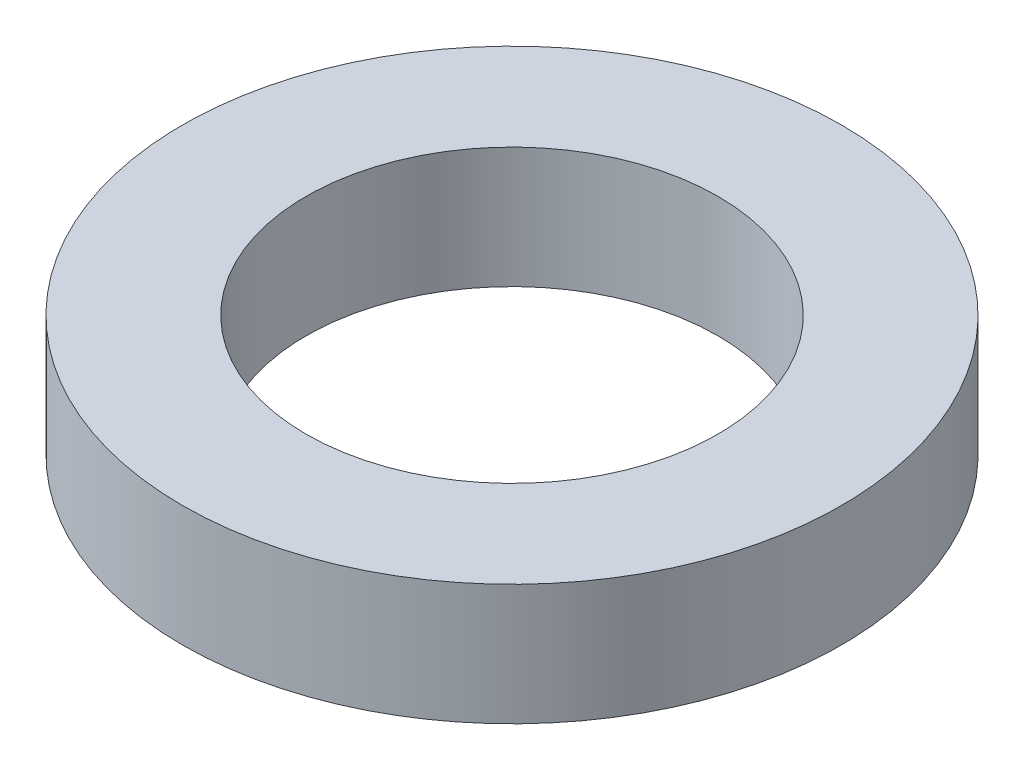
ISO-10303-21;
HEADER;
FILE_DESCRIPTION(('STEP AP214'),'2;1');
FILE_NAME('part.step','',(''),(''),'','','');
FILE_SCHEMA(('AUTOMOTIVE_DESIGN { 1 0 10303 214 1 1 1 1 }'));
ENDSEC;
DATA;
#1=APPLICATION_CONTEXT('core data for automotive mechanical design processes');
#2=APPLICATION_PROTOCOL_DEFINITION('international standard','automotive_design',2000,#1);
#3=PRODUCT_CONTEXT('',#1,'mechanical');
#4=PRODUCT('Part','Part','',(#3));
#5=PRODUCT_RELATED_PRODUCT_CATEGORY('part','',(#4));
#6=PRODUCT_DEFINITION_FORMATION('','',#4);
#7=PRODUCT_DEFINITION_CONTEXT('part definition',#1,'design');
#8=PRODUCT_DEFINITION('design','',#6,#7);
#9=PRODUCT_DEFINITION_SHAPE('','',#8);
#10=(LENGTH_UNIT() NAMED_UNIT(*) SI_UNIT(.MILLI.,.METRE.));
#11=(NAMED_UNIT(*) PLANE_ANGLE_UNIT() SI_UNIT($,.RADIAN.));
#12=(NAMED_UNIT(*) SI_UNIT($,.STERADIAN.) SOLID_ANGLE_UNIT());
#13=UNCERTAINTY_MEASURE_WITH_UNIT(LENGTH_MEASURE(1.E-05),#10,'distance_accuracy_value','');
#14=(GEOMETRIC_REPRESENTATION_CONTEXT(3) GLOBAL_UNCERTAINTY_ASSIGNED_CONTEXT((#13)) GLOBAL_UNIT_ASSIGNED_CONTEXT((#10,
#11,#12)) REPRESENTATION_CONTEXT('',''));
#15=CARTESIAN_POINT('',(0.,0.,0.));
#16=DIRECTION('',(0.,0.,1.));
#17=DIRECTION('',(1.,0.,0.));
#18=AXIS2_PLACEMENT_3D('',#15,#16,#17);
#19=CARTESIAN_POINT('',(0.,22.,0.));
#20=DIRECTION('',(0.,-1.,0.));
#21=DIRECTION('',(0.,0.,-1.));
#22=AXIS2_PLACEMENT_3D('',#19,#20,#21);
#23=CYLINDRICAL_SURFACE('',#22,60.);
#24=CARTESIAN_POINT('',(0.,22.,0.));
#25=DIRECTION('',(0.,1.,0.));
#26=DIRECTION('',(0.,0.,1.));
#27=AXIS2_PLACEMENT_3D('',#24,#25,#26);
#28=CIRCLE('',#27,60.);
#29=CARTESIAN_POINT('',(0.,22.,60.));
#30=VERTEX_POINT('',#29);
#31=EDGE_CURVE('E10',#30,#30,#28,.T.);
#32=ORIENTED_EDGE('',*,*,#31,.F.);
#33=EDGE_LOOP('',(#32));
#34=FACE_BOUND('',#33,.T.);
#35=CARTESIAN_POINT('',(0.,0.,0.));
#36=DIRECTION('',(0.,1.,0.));
#37=DIRECTION('',(0.,0.,1.));
#38=AXIS2_PLACEMENT_3D('',#35,#36,#37);
#39=CIRCLE('',#38,60.);
#40=CARTESIAN_POINT('',(0.,0.,60.));
#41=VERTEX_POINT('',#40);
#42=EDGE_CURVE('E37',#41,#41,#39,.T.);
#43=ORIENTED_EDGE('',*,*,#42,.T.);
#44=EDGE_LOOP('',(#43));
#45=FACE_BOUND('',#44,.T.);
#46=ADVANCED_FACE('F40',(#34,#45),#23,.T.);
#47=CARTESIAN_POINT('',(0.,22.,0.));
#48=DIRECTION('',(0.,1.,0.));
#49=DIRECTION('',(0.,0.,1.));
#50=AXIS2_PLACEMENT_3D('',#47,#48,#49);
#51=PLANE('',#50);
#52=CARTESIAN_POINT('',(0.,22.,0.));
#53=DIRECTION('',(0.,1.,0.));
#54=DIRECTION('',(0.,0.,1.));
#55=AXIS2_PLACEMENT_3D('',#52,#53,#54);
#56=CIRCLE('',#55,37.5);
#57=CARTESIAN_POINT('',(0.,22.,37.5));
#58=VERTEX_POINT('',#57);
#59=EDGE_CURVE('E50',#58,#58,#56,.T.);
#60=ORIENTED_EDGE('',*,*,#59,.F.);
#61=EDGE_LOOP('',(#60));
#62=FACE_BOUND('',#61,.T.);
#63=ORIENTED_EDGE('',*,*,#31,.T.);
#64=EDGE_LOOP('',(#63));
#65=FACE_BOUND('',#64,.T.);
#66=ADVANCED_FACE('F59',(#62,#65),#51,.T.);
#67=CARTESIAN_POINT('',(0.,0.,0.));
#68=DIRECTION('',(0.,1.,0.));
#69=DIRECTION('',(0.,0.,1.));
#70=AXIS2_PLACEMENT_3D('',#67,#68,#69);
#71=PLANE('',#70);
#72=CARTESIAN_POINT('',(0.,0.,0.));
#73=DIRECTION('',(0.,1.,0.));
#74=DIRECTION('',(0.,0.,1.));
#75=AXIS2_PLACEMENT_3D('',#72,#73,#74);
#76=CIRCLE('',#75,37.5);
#77=CARTESIAN_POINT('',(0.,0.,37.5));
#78=VERTEX_POINT('',#77);
#79=EDGE_CURVE('E47',#78,#78,#76,.T.);
#80=ORIENTED_EDGE('',*,*,#79,.T.);
#81=EDGE_LOOP('',(#80));
#82=FACE_BOUND('',#81,.T.);
#83=ORIENTED_EDGE('',*,*,#42,.F.);
#84=EDGE_LOOP('',(#83));
#85=FACE_BOUND('',#84,.T.);
#86=ADVANCED_FACE('F58',(#82,#85),#71,.F.);
#87=CARTESIAN_POINT('',(0.,22.,0.));
#88=DIRECTION('',(0.,-1.,0.));
#89=DIRECTION('',(0.,0.,-1.));
#90=AXIS2_PLACEMENT_3D('',#87,#88,#89);
#91=CYLINDRICAL_SURFACE('',#90,37.5);
#92=ORIENTED_EDGE('',*,*,#59,.T.);
#93=EDGE_LOOP('',(#92));
#94=FACE_BOUND('',#93,.T.);
#95=ORIENTED_EDGE('',*,*,#79,.F.);
#96=EDGE_LOOP('',(#95));
#97=FACE_BOUND('',#96,.T.);
#98=ADVANCED_FACE('F54',(#94,#97),#91,.F.);
#99=CLOSED_SHELL('',(#46,#66,#86,#98));
#100=MANIFOLD_SOLID_BREP('B2',#99);
#101=ADVANCED_BREP_SHAPE_REPRESENTATION('',(#18,#100),#14);
#102=SHAPE_DEFINITION_REPRESENTATION(#9,#101);
ENDSEC;
END-ISO-10303-21;
